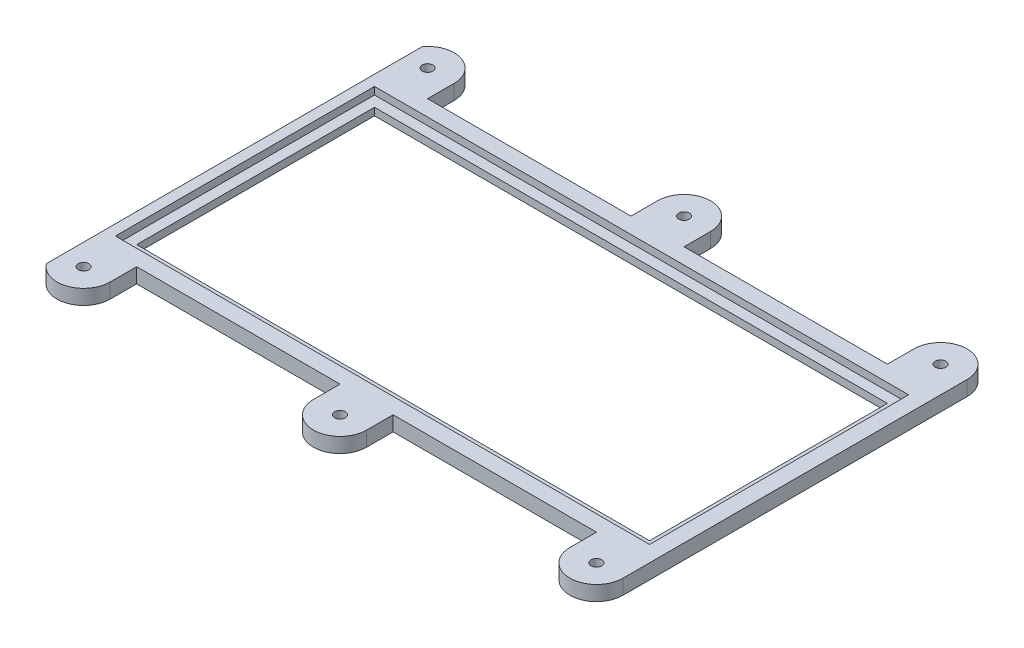
ISO-10303-21;
HEADER;
FILE_DESCRIPTION(('STEP AP214'),'2;1');
FILE_NAME('part.step','',(''),(''),'','','');
FILE_SCHEMA(('AUTOMOTIVE_DESIGN { 1 0 10303 214 1 1 1 1 }'));
ENDSEC;
DATA;
#1=APPLICATION_CONTEXT('core data for automotive mechanical design processes');
#2=APPLICATION_PROTOCOL_DEFINITION('international standard','automotive_design',2000,#1);
#3=PRODUCT_CONTEXT('',#1,'mechanical');
#4=PRODUCT('Part','Part','',(#3));
#5=PRODUCT_RELATED_PRODUCT_CATEGORY('part','',(#4));
#6=PRODUCT_DEFINITION_FORMATION('','',#4);
#7=PRODUCT_DEFINITION_CONTEXT('part definition',#1,'design');
#8=PRODUCT_DEFINITION('design','',#6,#7);
#9=PRODUCT_DEFINITION_SHAPE('','',#8);
#10=(LENGTH_UNIT() NAMED_UNIT(*) SI_UNIT(.MILLI.,.METRE.));
#11=(NAMED_UNIT(*) PLANE_ANGLE_UNIT() SI_UNIT($,.RADIAN.));
#12=(NAMED_UNIT(*) SI_UNIT($,.STERADIAN.) SOLID_ANGLE_UNIT());
#13=UNCERTAINTY_MEASURE_WITH_UNIT(LENGTH_MEASURE(1.E-05),#10,'distance_accuracy_value','');
#14=(GEOMETRIC_REPRESENTATION_CONTEXT(3) GLOBAL_UNCERTAINTY_ASSIGNED_CONTEXT((#13)) GLOBAL_UNIT_ASSIGNED_CONTEXT((#10,
#11,#12)) REPRESENTATION_CONTEXT('',''));
#15=CARTESIAN_POINT('',(0.,0.,0.));
#16=DIRECTION('',(0.,0.,1.));
#17=DIRECTION('',(1.,0.,0.));
#18=AXIS2_PLACEMENT_3D('',#15,#16,#17);
#19=CARTESIAN_POINT('',(26.65,0.7,-13.7));
#20=DIRECTION('',(0.,0.,1.));
#21=DIRECTION('',(1.,0.,0.));
#22=AXIS2_PLACEMENT_3D('',#19,#20,#21);
#23=PLANE('',#22);
#24=DIRECTION('',(0.,-1.,0.));
#25=VECTOR('',#24,1.);
#26=CARTESIAN_POINT('',(21.65,8.47106781186548,-13.7));
#27=LINE('',#26,#25);
#28=CARTESIAN_POINT('',(21.65,1.4,-13.7));
#29=VERTEX_POINT('',#28);
#30=CARTESIAN_POINT('',(21.65,0.,-13.7));
#31=VERTEX_POINT('',#30);
#32=EDGE_CURVE('E70',#29,#31,#27,.T.);
#33=ORIENTED_EDGE('',*,*,#32,.T.);
#34=DIRECTION('',(-1.,0.,0.));
#35=VECTOR('',#34,1.);
#36=CARTESIAN_POINT('',(26.65,0.,-13.7));
#37=LINE('',#36,#35);
#38=CARTESIAN_POINT('',(2.5,0.,-13.7));
#39=VERTEX_POINT('',#38);
#40=EDGE_CURVE('E56',#31,#39,#37,.T.);
#41=ORIENTED_EDGE('',*,*,#40,.T.);
#42=DIRECTION('',(0.,-1.,0.));
#43=VECTOR('',#42,1.);
#44=CARTESIAN_POINT('',(2.5,8.47106781186548,-13.7));
#45=LINE('',#44,#43);
#46=CARTESIAN_POINT('',(2.5,1.4,-13.7));
#47=VERTEX_POINT('',#46);
#48=EDGE_CURVE('E491',#47,#39,#45,.T.);
#49=ORIENTED_EDGE('',*,*,#48,.F.);
#50=DIRECTION('',(-1.,0.,0.));
#51=VECTOR('',#50,1.);
#52=CARTESIAN_POINT('',(26.65,1.4,-13.7));
#53=LINE('',#52,#51);
#54=EDGE_CURVE('E361',#29,#47,#53,.T.);
#55=ORIENTED_EDGE('',*,*,#54,.F.);
#56=EDGE_LOOP('',(#33,#41,#49,#55));
#57=FACE_BOUND('',#56,.T.);
#58=ADVANCED_FACE('F47',(#57),#23,.F.);
#59=CARTESIAN_POINT('',(26.65,0.7,13.7));
#60=DIRECTION('',(0.,0.,-1.));
#61=DIRECTION('',(-1.,0.,0.));
#62=AXIS2_PLACEMENT_3D('',#59,#60,#61);
#63=PLANE('',#62);
#64=DIRECTION('',(0.,-1.,0.));
#65=VECTOR('',#64,1.);
#66=CARTESIAN_POINT('',(-21.65,8.47106781186548,13.7));
#67=LINE('',#66,#65);
#68=CARTESIAN_POINT('',(-21.65,1.4,13.7));
#69=VERTEX_POINT('',#68);
#70=CARTESIAN_POINT('',(-21.65,0.,13.7));
#71=VERTEX_POINT('',#70);
#72=EDGE_CURVE('E261',#69,#71,#67,.T.);
#73=ORIENTED_EDGE('',*,*,#72,.T.);
#74=DIRECTION('',(1.,0.,0.));
#75=VECTOR('',#74,1.);
#76=CARTESIAN_POINT('',(26.65,0.,13.7));
#77=LINE('',#76,#75);
#78=CARTESIAN_POINT('',(-2.5,0.,13.7));
#79=VERTEX_POINT('',#78);
#80=EDGE_CURVE('E415',#71,#79,#77,.T.);
#81=ORIENTED_EDGE('',*,*,#80,.T.);
#82=DIRECTION('',(0.,-1.,0.));
#83=VECTOR('',#82,1.);
#84=CARTESIAN_POINT('',(-2.5,8.47106781186548,13.7));
#85=LINE('',#84,#83);
#86=CARTESIAN_POINT('',(-2.5,1.4,13.7));
#87=VERTEX_POINT('',#86);
#88=EDGE_CURVE('E307',#87,#79,#85,.T.);
#89=ORIENTED_EDGE('',*,*,#88,.F.);
#90=DIRECTION('',(1.,0.,0.));
#91=VECTOR('',#90,1.);
#92=CARTESIAN_POINT('',(-26.65,1.4,13.7));
#93=LINE('',#92,#91);
#94=EDGE_CURVE('E365',#69,#87,#93,.T.);
#95=ORIENTED_EDGE('',*,*,#94,.F.);
#96=EDGE_LOOP('',(#73,#81,#89,#95));
#97=FACE_BOUND('',#96,.T.);
#98=ADVANCED_FACE('F623',(#97),#63,.F.);
#99=CARTESIAN_POINT('',(0.,0.7,0.));
#100=DIRECTION('',(0.,1.,0.));
#101=DIRECTION('',(0.,0.,1.));
#102=AXIS2_PLACEMENT_3D('',#99,#100,#101);
#103=PLANE('',#102);
#104=DIRECTION('',(1.,0.,0.));
#105=VECTOR('',#104,1.);
#106=CARTESIAN_POINT('',(24.15,0.7,11.2));
#107=LINE('',#106,#105);
#108=CARTESIAN_POINT('',(-24.15,0.7,11.2));
#109=VERTEX_POINT('',#108);
#110=CARTESIAN_POINT('',(24.15,0.7,11.2));
#111=VERTEX_POINT('',#110);
#112=EDGE_CURVE('E375',#109,#111,#107,.T.);
#113=ORIENTED_EDGE('',*,*,#112,.F.);
#114=DIRECTION('',(0.,0.,1.));
#115=VECTOR('',#114,1.);
#116=CARTESIAN_POINT('',(-24.15,0.7,11.2));
#117=LINE('',#116,#115);
#118=CARTESIAN_POINT('',(-24.15,0.7,-11.2));
#119=VERTEX_POINT('',#118);
#120=EDGE_CURVE('E372',#119,#109,#117,.T.);
#121=ORIENTED_EDGE('',*,*,#120,.F.);
#122=DIRECTION('',(-1.,0.,0.));
#123=VECTOR('',#122,1.);
#124=CARTESIAN_POINT('',(24.15,0.7,-11.2));
#125=LINE('',#124,#123);
#126=CARTESIAN_POINT('',(24.15,0.7,-11.2));
#127=VERTEX_POINT('',#126);
#128=EDGE_CURVE('E383',#127,#119,#125,.T.);
#129=ORIENTED_EDGE('',*,*,#128,.F.);
#130=DIRECTION('',(0.,0.,-1.));
#131=VECTOR('',#130,1.);
#132=CARTESIAN_POINT('',(24.15,0.7,11.2));
#133=LINE('',#132,#131);
#134=EDGE_CURVE('E379',#111,#127,#133,.T.);
#135=ORIENTED_EDGE('',*,*,#134,.F.);
#136=EDGE_LOOP('',(#113,#121,#129,#135));
#137=FACE_BOUND('',#136,.T.);
#138=DIRECTION('',(0.,0.,-1.));
#139=VECTOR('',#138,1.);
#140=CARTESIAN_POINT('',(25.15,0.7,12.2));
#141=LINE('',#140,#139);
#142=CARTESIAN_POINT('',(25.15,0.7,12.2));
#143=VERTEX_POINT('',#142);
#144=CARTESIAN_POINT('',(25.15,0.7,-12.2));
#145=VERTEX_POINT('',#144);
#146=EDGE_CURVE('E323',#143,#145,#141,.T.);
#147=ORIENTED_EDGE('',*,*,#146,.T.);
#148=DIRECTION('',(-1.,0.,0.));
#149=VECTOR('',#148,1.);
#150=CARTESIAN_POINT('',(25.15,0.7,-12.2));
#151=LINE('',#150,#149);
#152=CARTESIAN_POINT('',(-25.15,0.7,-12.2));
#153=VERTEX_POINT('',#152);
#154=EDGE_CURVE('E286',#145,#153,#151,.T.);
#155=ORIENTED_EDGE('',*,*,#154,.T.);
#156=DIRECTION('',(0.,0.,1.));
#157=VECTOR('',#156,1.);
#158=CARTESIAN_POINT('',(-25.15,0.7,-12.2));
#159=LINE('',#158,#157);
#160=CARTESIAN_POINT('',(-25.15,0.7,12.2));
#161=VERTEX_POINT('',#160);
#162=EDGE_CURVE('E337',#153,#161,#159,.T.);
#163=ORIENTED_EDGE('',*,*,#162,.T.);
#164=DIRECTION('',(1.,0.,0.));
#165=VECTOR('',#164,1.);
#166=CARTESIAN_POINT('',(-25.15,0.7,12.2));
#167=LINE('',#166,#165);
#168=EDGE_CURVE('E341',#161,#143,#167,.T.);
#169=ORIENTED_EDGE('',*,*,#168,.T.);
#170=EDGE_LOOP('',(#147,#155,#163,#169));
#171=FACE_BOUND('',#170,.T.);
#172=ADVANCED_FACE('F550',(#137,#171),#103,.T.);
#173=CARTESIAN_POINT('',(0.,0.,0.));
#174=DIRECTION('',(0.,1.,0.));
#175=DIRECTION('',(0.,0.,1.));
#176=AXIS2_PLACEMENT_3D('',#173,#174,#175);
#177=PLANE('',#176);
#178=CARTESIAN_POINT('',(-24.15,0.,16.2));
#179=DIRECTION('',(0.,-1.,0.));
#180=DIRECTION('',(0.,0.,-1.));
#181=AXIS2_PLACEMENT_3D('',#178,#179,#180);
#182=CIRCLE('',#181,2.5);
#183=CARTESIAN_POINT('',(-21.65,0.,16.2));
#184=VERTEX_POINT('',#183);
#185=CARTESIAN_POINT('',(-26.15,0.,17.7));
#186=VERTEX_POINT('',#185);
#187=EDGE_CURVE('E246',#184,#186,#182,.T.);
#188=ORIENTED_EDGE('',*,*,#187,.T.);
#189=DIRECTION('',(0.,0.,-1.));
#190=VECTOR('',#189,1.);
#191=CARTESIAN_POINT('',(-26.15,0.,-26.9384030132517));
#192=LINE('',#191,#190);
#193=CARTESIAN_POINT('',(-26.15,0.,-17.7));
#194=VERTEX_POINT('',#193);
#195=EDGE_CURVE('E231',#186,#194,#192,.T.);
#196=ORIENTED_EDGE('',*,*,#195,.T.);
#197=CARTESIAN_POINT('',(-24.15,0.,-16.2));
#198=DIRECTION('',(0.,1.,0.));
#199=DIRECTION('',(0.,0.,1.));
#200=AXIS2_PLACEMENT_3D('',#197,#198,#199);
#201=CIRCLE('',#200,2.5);
#202=CARTESIAN_POINT('',(-21.65,0.,-16.2));
#203=VERTEX_POINT('',#202);
#204=EDGE_CURVE('E445',#203,#194,#201,.T.);
#205=ORIENTED_EDGE('',*,*,#204,.F.);
#206=DIRECTION('',(0.,0.,1.));
#207=VECTOR('',#206,1.);
#208=CARTESIAN_POINT('',(-21.65,0.,0.));
#209=LINE('',#208,#207);
#210=CARTESIAN_POINT('',(-21.65,0.,-13.7));
#211=VERTEX_POINT('',#210);
#212=EDGE_CURVE('E444',#203,#211,#209,.T.);
#213=ORIENTED_EDGE('',*,*,#212,.T.);
#214=CARTESIAN_POINT('',(-2.5,0.,-13.7));
#215=VERTEX_POINT('',#214);
#216=EDGE_CURVE('E420',#215,#211,#37,.T.);
#217=ORIENTED_EDGE('',*,*,#216,.F.);
#218=DIRECTION('',(0.,0.,1.));
#219=VECTOR('',#218,1.);
#220=CARTESIAN_POINT('',(-2.5,0.,0.));
#221=LINE('',#220,#219);
#222=CARTESIAN_POINT('',(-2.5,0.,-16.2));
#223=VERTEX_POINT('',#222);
#224=EDGE_CURVE('E441',#223,#215,#221,.T.);
#225=ORIENTED_EDGE('',*,*,#224,.F.);
#226=CARTESIAN_POINT('',(0.,0.,-16.2));
#227=DIRECTION('',(0.,1.,0.));
#228=DIRECTION('',(0.,0.,1.));
#229=AXIS2_PLACEMENT_3D('',#226,#227,#228);
#230=CIRCLE('',#229,2.5);
#231=CARTESIAN_POINT('',(2.5,0.,-16.2));
#232=VERTEX_POINT('',#231);
#233=EDGE_CURVE('E488',#232,#223,#230,.T.);
#234=ORIENTED_EDGE('',*,*,#233,.F.);
#235=DIRECTION('',(0.,0.,1.));
#236=VECTOR('',#235,1.);
#237=CARTESIAN_POINT('',(2.5,0.,0.));
#238=LINE('',#237,#236);
#239=EDGE_CURVE('E482',#232,#39,#238,.T.);
#240=ORIENTED_EDGE('',*,*,#239,.T.);
#241=ORIENTED_EDGE('',*,*,#40,.F.);
#242=DIRECTION('',(0.,0.,1.));
#243=VECTOR('',#242,1.);
#244=CARTESIAN_POINT('',(21.65,0.,0.));
#245=LINE('',#244,#243);
#246=CARTESIAN_POINT('',(21.65,0.,-16.2));
#247=VERTEX_POINT('',#246);
#248=EDGE_CURVE('E563',#247,#31,#245,.T.);
#249=ORIENTED_EDGE('',*,*,#248,.F.);
#250=CARTESIAN_POINT('',(24.15,0.,-16.2));
#251=DIRECTION('',(0.,1.,0.));
#252=DIRECTION('',(0.,0.,1.));
#253=AXIS2_PLACEMENT_3D('',#250,#251,#252);
#254=CIRCLE('',#253,2.5);
#255=CARTESIAN_POINT('',(26.65,0.,-16.2));
#256=VERTEX_POINT('',#255);
#257=EDGE_CURVE('E568',#256,#247,#254,.T.);
#258=ORIENTED_EDGE('',*,*,#257,.F.);
#259=DIRECTION('',(0.,0.,-1.));
#260=VECTOR('',#259,1.);
#261=CARTESIAN_POINT('',(26.65,0.,13.7));
#262=LINE('',#261,#260);
#263=CARTESIAN_POINT('',(26.65,0.,16.2));
#264=VERTEX_POINT('',#263);
#265=EDGE_CURVE('E418',#264,#256,#262,.T.);
#266=ORIENTED_EDGE('',*,*,#265,.F.);
#267=CARTESIAN_POINT('',(24.15,0.,16.2));
#268=DIRECTION('',(0.,-1.,0.));
#269=DIRECTION('',(0.,0.,-1.));
#270=AXIS2_PLACEMENT_3D('',#267,#268,#269);
#271=CIRCLE('',#270,2.5);
#272=CARTESIAN_POINT('',(21.65,0.,16.2));
#273=VERTEX_POINT('',#272);
#274=EDGE_CURVE('E515',#264,#273,#271,.T.);
#275=ORIENTED_EDGE('',*,*,#274,.T.);
#276=DIRECTION('',(0.,0.,-1.));
#277=VECTOR('',#276,1.);
#278=CARTESIAN_POINT('',(21.65,0.,0.));
#279=LINE('',#278,#277);
#280=CARTESIAN_POINT('',(21.65,0.,13.7));
#281=VERTEX_POINT('',#280);
#282=EDGE_CURVE('E519',#273,#281,#279,.T.);
#283=ORIENTED_EDGE('',*,*,#282,.T.);
#284=CARTESIAN_POINT('',(2.5,0.,13.7));
#285=VERTEX_POINT('',#284);
#286=EDGE_CURVE('E414',#285,#281,#77,.T.);
#287=ORIENTED_EDGE('',*,*,#286,.F.);
#288=DIRECTION('',(0.,0.,-1.));
#289=VECTOR('',#288,1.);
#290=CARTESIAN_POINT('',(2.5,0.,0.));
#291=LINE('',#290,#289);
#292=CARTESIAN_POINT('',(2.5,0.,16.2));
#293=VERTEX_POINT('',#292);
#294=EDGE_CURVE('E291',#293,#285,#291,.T.);
#295=ORIENTED_EDGE('',*,*,#294,.F.);
#296=CARTESIAN_POINT('',(0.,0.,16.2));
#297=DIRECTION('',(0.,-1.,0.));
#298=DIRECTION('',(0.,0.,-1.));
#299=AXIS2_PLACEMENT_3D('',#296,#297,#298);
#300=CIRCLE('',#299,2.5);
#301=CARTESIAN_POINT('',(-2.5,0.,16.2));
#302=VERTEX_POINT('',#301);
#303=EDGE_CURVE('E295',#293,#302,#300,.T.);
#304=ORIENTED_EDGE('',*,*,#303,.T.);
#305=DIRECTION('',(0.,0.,-1.));
#306=VECTOR('',#305,1.);
#307=CARTESIAN_POINT('',(-2.5,0.,0.));
#308=LINE('',#307,#306);
#309=EDGE_CURVE('E299',#302,#79,#308,.T.);
#310=ORIENTED_EDGE('',*,*,#309,.T.);
#311=ORIENTED_EDGE('',*,*,#80,.F.);
#312=DIRECTION('',(0.,0.,-1.));
#313=VECTOR('',#312,1.);
#314=CARTESIAN_POINT('',(-21.65,0.,0.));
#315=LINE('',#314,#313);
#316=EDGE_CURVE('E255',#184,#71,#315,.T.);
#317=ORIENTED_EDGE('',*,*,#316,.F.);
#318=EDGE_LOOP('',(#188,#196,#205,#213,#217,#225,#234,#240,#241,#249,#258,#266,#275,#283,#287,
#295,#304,#310,#311,#317));
#319=FACE_BOUND('',#318,.T.);
#320=DIRECTION('',(0.,0.,1.));
#321=VECTOR('',#320,1.);
#322=CARTESIAN_POINT('',(-24.15,0.,11.2));
#323=LINE('',#322,#321);
#324=CARTESIAN_POINT('',(-24.15,0.,-11.2));
#325=VERTEX_POINT('',#324);
#326=CARTESIAN_POINT('',(-24.15,0.,11.2));
#327=VERTEX_POINT('',#326);
#328=EDGE_CURVE('E371',#325,#327,#323,.T.);
#329=ORIENTED_EDGE('',*,*,#328,.T.);
#330=DIRECTION('',(1.,0.,0.));
#331=VECTOR('',#330,1.);
#332=CARTESIAN_POINT('',(24.15,0.,11.2));
#333=LINE('',#332,#331);
#334=CARTESIAN_POINT('',(24.15,0.,11.2));
#335=VERTEX_POINT('',#334);
#336=EDGE_CURVE('E390',#327,#335,#333,.T.);
#337=ORIENTED_EDGE('',*,*,#336,.T.);
#338=DIRECTION('',(0.,0.,-1.));
#339=VECTOR('',#338,1.);
#340=CARTESIAN_POINT('',(24.15,0.,11.2));
#341=LINE('',#340,#339);
#342=CARTESIAN_POINT('',(24.15,0.,-11.2));
#343=VERTEX_POINT('',#342);
#344=EDGE_CURVE('E394',#335,#343,#341,.T.);
#345=ORIENTED_EDGE('',*,*,#344,.T.);
#346=DIRECTION('',(-1.,0.,0.));
#347=VECTOR('',#346,1.);
#348=CARTESIAN_POINT('',(24.15,0.,-11.2));
#349=LINE('',#348,#347);
#350=EDGE_CURVE('E376',#343,#325,#349,.T.);
#351=ORIENTED_EDGE('',*,*,#350,.T.);
#352=EDGE_LOOP('',(#329,#337,#345,#351));
#353=FACE_BOUND('',#352,.T.);
#354=CARTESIAN_POINT('',(0.,0.,16.2));
#355=DIRECTION('',(0.,-1.,0.));
#356=DIRECTION('',(0.,0.,-1.));
#357=AXIS2_PLACEMENT_3D('',#354,#355,#356);
#358=CIRCLE('',#357,0.500000000000001);
#359=CARTESIAN_POINT('',(0.,0.,15.7));
#360=VERTEX_POINT('',#359);
#361=EDGE_CURVE('E281',#360,#360,#358,.T.);
#362=ORIENTED_EDGE('',*,*,#361,.F.);
#363=EDGE_LOOP('',(#362));
#364=FACE_BOUND('',#363,.T.);
#365=CARTESIAN_POINT('',(-24.15,0.,16.2));
#366=DIRECTION('',(0.,-1.,0.));
#367=DIRECTION('',(0.,0.,-1.));
#368=AXIS2_PLACEMENT_3D('',#365,#366,#367);
#369=CIRCLE('',#368,0.499999999999999);
#370=CARTESIAN_POINT('',(-24.15,0.,15.7));
#371=VERTEX_POINT('',#370);
#372=EDGE_CURVE('E263',#371,#371,#369,.T.);
#373=ORIENTED_EDGE('',*,*,#372,.F.);
#374=EDGE_LOOP('',(#373));
#375=FACE_BOUND('',#374,.T.);
#376=CARTESIAN_POINT('',(24.15,0.,16.2));
#377=DIRECTION('',(0.,-1.,0.));
#378=DIRECTION('',(0.,0.,-1.));
#379=AXIS2_PLACEMENT_3D('',#376,#377,#378);
#380=CIRCLE('',#379,0.499999999999999);
#381=CARTESIAN_POINT('',(24.15,0.,15.7));
#382=VERTEX_POINT('',#381);
#383=EDGE_CURVE('E505',#382,#382,#380,.T.);
#384=ORIENTED_EDGE('',*,*,#383,.F.);
#385=EDGE_LOOP('',(#384));
#386=FACE_BOUND('',#385,.T.);
#387=CARTESIAN_POINT('',(0.,0.,-16.2));
#388=DIRECTION('',(0.,1.,0.));
#389=DIRECTION('',(0.,0.,1.));
#390=AXIS2_PLACEMENT_3D('',#387,#388,#389);
#391=CIRCLE('',#390,0.500000000000001);
#392=CARTESIAN_POINT('',(0.,0.,-15.7));
#393=VERTEX_POINT('',#392);
#394=EDGE_CURVE('E478',#393,#393,#391,.T.);
#395=ORIENTED_EDGE('',*,*,#394,.T.);
#396=EDGE_LOOP('',(#395));
#397=FACE_BOUND('',#396,.T.);
#398=CARTESIAN_POINT('',(-24.15,0.,-16.2));
#399=DIRECTION('',(0.,1.,0.));
#400=DIRECTION('',(0.,0.,1.));
#401=AXIS2_PLACEMENT_3D('',#398,#399,#400);
#402=CIRCLE('',#401,0.499999999999999);
#403=CARTESIAN_POINT('',(-24.15,0.,-15.7));
#404=VERTEX_POINT('',#403);
#405=EDGE_CURVE('E449',#404,#404,#402,.T.);
#406=ORIENTED_EDGE('',*,*,#405,.T.);
#407=EDGE_LOOP('',(#406));
#408=FACE_BOUND('',#407,.T.);
#409=CARTESIAN_POINT('',(24.15,0.,-16.2));
#410=DIRECTION('',(0.,1.,0.));
#411=DIRECTION('',(0.,0.,1.));
#412=AXIS2_PLACEMENT_3D('',#409,#410,#411);
#413=CIRCLE('',#412,0.499999999999999);
#414=CARTESIAN_POINT('',(24.15,0.,-15.7));
#415=VERTEX_POINT('',#414);
#416=EDGE_CURVE('E560',#415,#415,#413,.T.);
#417=ORIENTED_EDGE('',*,*,#416,.T.);
#418=EDGE_LOOP('',(#417));
#419=FACE_BOUND('',#418,.T.);
#420=ADVANCED_FACE('F252',(#319,#353,#364,#375,#386,#397,#408,#419),#177,.F.);
#421=ORIENTED_EDGE('',*,*,#286,.T.);
#422=DIRECTION('',(0.,-1.,0.));
#423=VECTOR('',#422,1.);
#424=CARTESIAN_POINT('',(21.65,8.47106781186548,13.7));
#425=LINE('',#424,#423);
#426=CARTESIAN_POINT('',(21.65,1.4,13.7));
#427=VERTEX_POINT('',#426);
#428=EDGE_CURVE('E524',#427,#281,#425,.T.);
#429=ORIENTED_EDGE('',*,*,#428,.F.);
#430=CARTESIAN_POINT('',(2.5,1.4,13.7));
#431=VERTEX_POINT('',#430);
#432=EDGE_CURVE('E364',#431,#427,#93,.T.);
#433=ORIENTED_EDGE('',*,*,#432,.F.);
#434=DIRECTION('',(0.,-1.,0.));
#435=VECTOR('',#434,1.);
#436=CARTESIAN_POINT('',(2.5,8.47106781186548,13.7));
#437=LINE('',#436,#435);
#438=EDGE_CURVE('E304',#431,#285,#437,.T.);
#439=ORIENTED_EDGE('',*,*,#438,.T.);
#440=EDGE_LOOP('',(#421,#429,#433,#439));
#441=FACE_BOUND('',#440,.T.);
#442=ADVANCED_FACE('F49',(#441),#63,.F.);
#443=CARTESIAN_POINT('',(26.65,0.7,13.7));
#444=DIRECTION('',(-1.,0.,0.));
#445=DIRECTION('',(0.,0.,1.));
#446=AXIS2_PLACEMENT_3D('',#443,#444,#445);
#447=PLANE('',#446);
#448=ORIENTED_EDGE('',*,*,#265,.T.);
#449=DIRECTION('',(0.,-1.,0.));
#450=VECTOR('',#449,1.);
#451=CARTESIAN_POINT('',(26.65,8.47106781186548,-16.2));
#452=LINE('',#451,#450);
#453=CARTESIAN_POINT('',(26.65,1.4,-16.2));
#454=VERTEX_POINT('',#453);
#455=EDGE_CURVE('E578',#454,#256,#452,.T.);
#456=ORIENTED_EDGE('',*,*,#455,.F.);
#457=DIRECTION('',(0.,0.,-1.));
#458=VECTOR('',#457,1.);
#459=CARTESIAN_POINT('',(26.65,1.4,13.7));
#460=LINE('',#459,#458);
#461=CARTESIAN_POINT('',(26.65,1.4,16.2));
#462=VERTEX_POINT('',#461);
#463=EDGE_CURVE('E368',#462,#454,#460,.T.);
#464=ORIENTED_EDGE('',*,*,#463,.F.);
#465=DIRECTION('',(0.,-1.,0.));
#466=VECTOR('',#465,1.);
#467=CARTESIAN_POINT('',(26.65,8.47106781186548,16.2));
#468=LINE('',#467,#466);
#469=EDGE_CURVE('E523',#462,#264,#468,.T.);
#470=ORIENTED_EDGE('',*,*,#469,.T.);
#471=EDGE_LOOP('',(#448,#456,#464,#470));
#472=FACE_BOUND('',#471,.T.);
#473=ADVANCED_FACE('F631',(#472),#447,.F.);
#474=ORIENTED_EDGE('',*,*,#216,.T.);
#475=DIRECTION('',(0.,-1.,0.));
#476=VECTOR('',#475,1.);
#477=CARTESIAN_POINT('',(-21.65,8.47106781186548,-13.7));
#478=LINE('',#477,#476);
#479=CARTESIAN_POINT('',(-21.65,1.4,-13.7));
#480=VERTEX_POINT('',#479);
#481=EDGE_CURVE('E434',#480,#211,#478,.T.);
#482=ORIENTED_EDGE('',*,*,#481,.F.);
#483=CARTESIAN_POINT('',(-2.5,1.4,-13.7));
#484=VERTEX_POINT('',#483);
#485=EDGE_CURVE('E360',#484,#480,#53,.T.);
#486=ORIENTED_EDGE('',*,*,#485,.F.);
#487=DIRECTION('',(0.,-1.,0.));
#488=VECTOR('',#487,1.);
#489=CARTESIAN_POINT('',(-2.5,8.47106781186548,-13.7));
#490=LINE('',#489,#488);
#491=EDGE_CURVE('E437',#484,#215,#490,.T.);
#492=ORIENTED_EDGE('',*,*,#491,.T.);
#493=EDGE_LOOP('',(#474,#482,#486,#492));
#494=FACE_BOUND('',#493,.T.);
#495=ADVANCED_FACE('F432',(#494),#23,.F.);
#496=CARTESIAN_POINT('',(-24.15,0.7,11.2));
#497=DIRECTION('',(1.,0.,0.));
#498=DIRECTION('',(0.,0.,-1.));
#499=AXIS2_PLACEMENT_3D('',#496,#497,#498);
#500=PLANE('',#499);
#501=ORIENTED_EDGE('',*,*,#328,.F.);
#502=DIRECTION('',(0.,-1.,0.));
#503=VECTOR('',#502,1.);
#504=CARTESIAN_POINT('',(-24.15,0.7,-11.2));
#505=LINE('',#504,#503);
#506=EDGE_CURVE('E386',#119,#325,#505,.T.);
#507=ORIENTED_EDGE('',*,*,#506,.F.);
#508=ORIENTED_EDGE('',*,*,#120,.T.);
#509=DIRECTION('',(0.,-1.,0.));
#510=VECTOR('',#509,1.);
#511=CARTESIAN_POINT('',(-24.15,0.7,11.2));
#512=LINE('',#511,#510);
#513=EDGE_CURVE('E410',#109,#327,#512,.T.);
#514=ORIENTED_EDGE('',*,*,#513,.T.);
#515=EDGE_LOOP('',(#501,#507,#508,#514));
#516=FACE_BOUND('',#515,.T.);
#517=ADVANCED_FACE('F630',(#516),#500,.T.);
#518=CARTESIAN_POINT('',(24.15,0.7,11.2));
#519=DIRECTION('',(0.,0.,-1.));
#520=DIRECTION('',(-1.,0.,0.));
#521=AXIS2_PLACEMENT_3D('',#518,#519,#520);
#522=PLANE('',#521);
#523=ORIENTED_EDGE('',*,*,#336,.F.);
#524=ORIENTED_EDGE('',*,*,#513,.F.);
#525=ORIENTED_EDGE('',*,*,#112,.T.);
#526=DIRECTION('',(0.,-1.,0.));
#527=VECTOR('',#526,1.);
#528=CARTESIAN_POINT('',(24.15,0.7,11.2));
#529=LINE('',#528,#527);
#530=EDGE_CURVE('E407',#111,#335,#529,.T.);
#531=ORIENTED_EDGE('',*,*,#530,.T.);
#532=EDGE_LOOP('',(#523,#524,#525,#531));
#533=FACE_BOUND('',#532,.T.);
#534=ADVANCED_FACE('F636',(#533),#522,.T.);
#535=CARTESIAN_POINT('',(24.15,0.7,11.2));
#536=DIRECTION('',(-1.,0.,0.));
#537=DIRECTION('',(0.,0.,1.));
#538=AXIS2_PLACEMENT_3D('',#535,#536,#537);
#539=PLANE('',#538);
#540=ORIENTED_EDGE('',*,*,#344,.F.);
#541=ORIENTED_EDGE('',*,*,#530,.F.);
#542=ORIENTED_EDGE('',*,*,#134,.T.);
#543=DIRECTION('',(0.,-1.,0.));
#544=VECTOR('',#543,1.);
#545=CARTESIAN_POINT('',(24.15,0.7,-11.2));
#546=LINE('',#545,#544);
#547=EDGE_CURVE('E404',#127,#343,#546,.T.);
#548=ORIENTED_EDGE('',*,*,#547,.T.);
#549=EDGE_LOOP('',(#540,#541,#542,#548));
#550=FACE_BOUND('',#549,.T.);
#551=ADVANCED_FACE('F752',(#550),#539,.T.);
#552=CARTESIAN_POINT('',(24.15,0.7,-11.2));
#553=DIRECTION('',(0.,0.,1.));
#554=DIRECTION('',(1.,0.,0.));
#555=AXIS2_PLACEMENT_3D('',#552,#553,#554);
#556=PLANE('',#555);
#557=ORIENTED_EDGE('',*,*,#350,.F.);
#558=ORIENTED_EDGE('',*,*,#547,.F.);
#559=ORIENTED_EDGE('',*,*,#128,.T.);
#560=ORIENTED_EDGE('',*,*,#506,.T.);
#561=EDGE_LOOP('',(#557,#558,#559,#560));
#562=FACE_BOUND('',#561,.T.);
#563=ADVANCED_FACE('F603',(#562),#556,.T.);
#564=CARTESIAN_POINT('',(0.,1.4,0.));
#565=DIRECTION('',(0.,1.,0.));
#566=DIRECTION('',(0.,0.,1.));
#567=AXIS2_PLACEMENT_3D('',#564,#565,#566);
#568=PLANE('',#567);
#569=DIRECTION('',(0.,0.,-1.));
#570=VECTOR('',#569,1.);
#571=CARTESIAN_POINT('',(-26.15,1.4,0.));
#572=LINE('',#571,#570);
#573=CARTESIAN_POINT('',(-26.15,1.4,17.7));
#574=VERTEX_POINT('',#573);
#575=CARTESIAN_POINT('',(-26.15,1.4,-17.7));
#576=VERTEX_POINT('',#575);
#577=EDGE_CURVE('E63',#574,#576,#572,.T.);
#578=ORIENTED_EDGE('',*,*,#577,.F.);
#579=CARTESIAN_POINT('',(-24.15,1.4,16.2));
#580=DIRECTION('',(0.,1.,0.));
#581=DIRECTION('',(0.,0.,1.));
#582=AXIS2_PLACEMENT_3D('',#579,#580,#581);
#583=CIRCLE('',#582,2.5);
#584=CARTESIAN_POINT('',(-21.65,1.4,16.2));
#585=VERTEX_POINT('',#584);
#586=EDGE_CURVE('E247',#585,#574,#583,.F.);
#587=ORIENTED_EDGE('',*,*,#586,.F.);
#588=DIRECTION('',(0.,0.,-1.));
#589=VECTOR('',#588,1.);
#590=CARTESIAN_POINT('',(-21.65,1.4,0.));
#591=LINE('',#590,#589);
#592=EDGE_CURVE('E510',#585,#69,#591,.T.);
#593=ORIENTED_EDGE('',*,*,#592,.T.);
#594=ORIENTED_EDGE('',*,*,#94,.T.);
#595=DIRECTION('',(0.,0.,-1.));
#596=VECTOR('',#595,1.);
#597=CARTESIAN_POINT('',(-2.5,1.4,0.));
#598=LINE('',#597,#596);
#599=CARTESIAN_POINT('',(-2.5,1.4,16.2));
#600=VERTEX_POINT('',#599);
#601=EDGE_CURVE('E273',#600,#87,#598,.T.);
#602=ORIENTED_EDGE('',*,*,#601,.F.);
#603=CARTESIAN_POINT('',(0.,1.4,16.2));
#604=DIRECTION('',(0.,1.,0.));
#605=DIRECTION('',(0.,0.,1.));
#606=AXIS2_PLACEMENT_3D('',#603,#604,#605);
#607=CIRCLE('',#606,2.5);
#608=CARTESIAN_POINT('',(2.5,1.4,16.2));
#609=VERTEX_POINT('',#608);
#610=EDGE_CURVE('E287',#609,#600,#607,.F.);
#611=ORIENTED_EDGE('',*,*,#610,.F.);
#612=DIRECTION('',(0.,0.,-1.));
#613=VECTOR('',#612,1.);
#614=CARTESIAN_POINT('',(2.5,1.4,0.));
#615=LINE('',#614,#613);
#616=EDGE_CURVE('E277',#609,#431,#615,.T.);
#617=ORIENTED_EDGE('',*,*,#616,.T.);
#618=ORIENTED_EDGE('',*,*,#432,.T.);
#619=DIRECTION('',(0.,0.,-1.));
#620=VECTOR('',#619,1.);
#621=CARTESIAN_POINT('',(21.65,1.4,0.));
#622=LINE('',#621,#620);
#623=CARTESIAN_POINT('',(21.65,1.4,16.2));
#624=VERTEX_POINT('',#623);
#625=EDGE_CURVE('E495',#624,#427,#622,.T.);
#626=ORIENTED_EDGE('',*,*,#625,.F.);
#627=CARTESIAN_POINT('',(24.15,1.4,16.2));
#628=DIRECTION('',(0.,1.,0.));
#629=DIRECTION('',(0.,0.,1.));
#630=AXIS2_PLACEMENT_3D('',#627,#628,#629);
#631=CIRCLE('',#630,2.5);
#632=EDGE_CURVE('E511',#462,#624,#631,.F.);
#633=ORIENTED_EDGE('',*,*,#632,.F.);
#634=ORIENTED_EDGE('',*,*,#463,.T.);
#635=CARTESIAN_POINT('',(24.15,1.4,-16.2));
#636=DIRECTION('',(0.,1.,0.));
#637=DIRECTION('',(0.,0.,1.));
#638=AXIS2_PLACEMENT_3D('',#635,#636,#637);
#639=CIRCLE('',#638,2.5);
#640=CARTESIAN_POINT('',(21.65,1.4,-16.2));
#641=VERTEX_POINT('',#640);
#642=EDGE_CURVE('E571',#454,#641,#639,.T.);
#643=ORIENTED_EDGE('',*,*,#642,.T.);
#644=DIRECTION('',(0.,0.,1.));
#645=VECTOR('',#644,1.);
#646=CARTESIAN_POINT('',(21.65,1.4,0.));
#647=LINE('',#646,#645);
#648=EDGE_CURVE('E249',#641,#29,#647,.T.);
#649=ORIENTED_EDGE('',*,*,#648,.T.);
#650=ORIENTED_EDGE('',*,*,#54,.T.);
#651=DIRECTION('',(0.,0.,1.));
#652=VECTOR('',#651,1.);
#653=CARTESIAN_POINT('',(2.5,1.4,0.));
#654=LINE('',#653,#652);
#655=CARTESIAN_POINT('',(2.5,1.4,-16.2));
#656=VERTEX_POINT('',#655);
#657=EDGE_CURVE('E470',#656,#47,#654,.T.);
#658=ORIENTED_EDGE('',*,*,#657,.F.);
#659=CARTESIAN_POINT('',(0.,1.4,-16.2));
#660=DIRECTION('',(0.,1.,0.));
#661=DIRECTION('',(0.,0.,1.));
#662=AXIS2_PLACEMENT_3D('',#659,#660,#661);
#663=CIRCLE('',#662,2.5);
#664=CARTESIAN_POINT('',(-2.5,1.4,-16.2));
#665=VERTEX_POINT('',#664);
#666=EDGE_CURVE('E467',#656,#665,#663,.T.);
#667=ORIENTED_EDGE('',*,*,#666,.T.);
#668=DIRECTION('',(0.,0.,1.));
#669=VECTOR('',#668,1.);
#670=CARTESIAN_POINT('',(-2.5,1.4,0.));
#671=LINE('',#670,#669);
#672=EDGE_CURVE('E462',#665,#484,#671,.T.);
#673=ORIENTED_EDGE('',*,*,#672,.T.);
#674=ORIENTED_EDGE('',*,*,#485,.T.);
#675=DIRECTION('',(0.,0.,1.));
#676=VECTOR('',#675,1.);
#677=CARTESIAN_POINT('',(-21.65,1.4,0.));
#678=LINE('',#677,#676);
#679=CARTESIAN_POINT('',(-21.65,1.4,-16.2));
#680=VERTEX_POINT('',#679);
#681=EDGE_CURVE('E591',#680,#480,#678,.T.);
#682=ORIENTED_EDGE('',*,*,#681,.F.);
#683=CARTESIAN_POINT('',(-24.15,1.4,-16.2));
#684=DIRECTION('',(0.,1.,0.));
#685=DIRECTION('',(0.,0.,1.));
#686=AXIS2_PLACEMENT_3D('',#683,#684,#685);
#687=CIRCLE('',#686,2.5);
#688=EDGE_CURVE('E582',#680,#576,#687,.T.);
#689=ORIENTED_EDGE('',*,*,#688,.T.);
#690=EDGE_LOOP('',(#578,#587,#593,#594,#602,#611,#617,#618,#626,#633,#634,#643,#649,#650,#658,
#667,#673,#674,#682,#689));
#691=FACE_BOUND('',#690,.T.);
#692=DIRECTION('',(0.,0.,1.));
#693=VECTOR('',#692,1.);
#694=CARTESIAN_POINT('',(-25.15,1.4,-12.2));
#695=LINE('',#694,#693);
#696=CARTESIAN_POINT('',(-25.15,1.4,-12.2));
#697=VERTEX_POINT('',#696);
#698=CARTESIAN_POINT('',(-25.15,1.4,12.2));
#699=VERTEX_POINT('',#698);
#700=EDGE_CURVE('E322',#697,#699,#695,.T.);
#701=ORIENTED_EDGE('',*,*,#700,.F.);
#702=DIRECTION('',(-1.,0.,0.));
#703=VECTOR('',#702,1.);
#704=CARTESIAN_POINT('',(25.15,1.4,-12.2));
#705=LINE('',#704,#703);
#706=CARTESIAN_POINT('',(25.15,1.4,-12.2));
#707=VERTEX_POINT('',#706);
#708=EDGE_CURVE('E319',#707,#697,#705,.T.);
#709=ORIENTED_EDGE('',*,*,#708,.F.);
#710=DIRECTION('',(0.,0.,-1.));
#711=VECTOR('',#710,1.);
#712=CARTESIAN_POINT('',(25.15,1.4,12.2));
#713=LINE('',#712,#711);
#714=CARTESIAN_POINT('',(25.15,1.4,12.2));
#715=VERTEX_POINT('',#714);
#716=EDGE_CURVE('E330',#715,#707,#713,.T.);
#717=ORIENTED_EDGE('',*,*,#716,.F.);
#718=DIRECTION('',(1.,0.,0.));
#719=VECTOR('',#718,1.);
#720=CARTESIAN_POINT('',(-25.15,1.4,12.2));
#721=LINE('',#720,#719);
#722=EDGE_CURVE('E326',#699,#715,#721,.T.);
#723=ORIENTED_EDGE('',*,*,#722,.F.);
#724=EDGE_LOOP('',(#701,#709,#717,#723));
#725=FACE_BOUND('',#724,.T.);
#726=CARTESIAN_POINT('',(0.,1.4,16.2));
#727=DIRECTION('',(0.,1.,0.));
#728=DIRECTION('',(0.,0.,1.));
#729=AXIS2_PLACEMENT_3D('',#726,#727,#728);
#730=CIRCLE('',#729,0.500000000000001);
#731=CARTESIAN_POINT('',(0.,1.4,16.7));
#732=VERTEX_POINT('',#731);
#733=EDGE_CURVE('E282',#732,#732,#730,.F.);
#734=ORIENTED_EDGE('',*,*,#733,.T.);
#735=EDGE_LOOP('',(#734));
#736=FACE_BOUND('',#735,.T.);
#737=CARTESIAN_POINT('',(-24.15,1.4,16.2));
#738=DIRECTION('',(0.,1.,0.));
#739=DIRECTION('',(0.,0.,1.));
#740=AXIS2_PLACEMENT_3D('',#737,#738,#739);
#741=CIRCLE('',#740,0.499999999999999);
#742=CARTESIAN_POINT('',(-24.15,1.4,16.7));
#743=VERTEX_POINT('',#742);
#744=EDGE_CURVE('E272',#743,#743,#741,.F.);
#745=ORIENTED_EDGE('',*,*,#744,.T.);
#746=EDGE_LOOP('',(#745));
#747=FACE_BOUND('',#746,.T.);
#748=CARTESIAN_POINT('',(24.15,1.4,16.2));
#749=DIRECTION('',(0.,1.,0.));
#750=DIRECTION('',(0.,0.,1.));
#751=AXIS2_PLACEMENT_3D('',#748,#749,#750);
#752=CIRCLE('',#751,0.499999999999999);
#753=CARTESIAN_POINT('',(24.15,1.4,16.7));
#754=VERTEX_POINT('',#753);
#755=EDGE_CURVE('E506',#754,#754,#752,.F.);
#756=ORIENTED_EDGE('',*,*,#755,.T.);
#757=EDGE_LOOP('',(#756));
#758=FACE_BOUND('',#757,.T.);
#759=CARTESIAN_POINT('',(0.,1.4,-16.2));
#760=DIRECTION('',(0.,1.,0.));
#761=DIRECTION('',(0.,0.,1.));
#762=AXIS2_PLACEMENT_3D('',#759,#760,#761);
#763=CIRCLE('',#762,0.500000000000001);
#764=CARTESIAN_POINT('',(0.,1.4,-15.7));
#765=VERTEX_POINT('',#764);
#766=EDGE_CURVE('E474',#765,#765,#763,.T.);
#767=ORIENTED_EDGE('',*,*,#766,.F.);
#768=EDGE_LOOP('',(#767));
#769=FACE_BOUND('',#768,.T.);
#770=CARTESIAN_POINT('',(-24.15,1.4,-16.2));
#771=DIRECTION('',(0.,1.,0.));
#772=DIRECTION('',(0.,0.,1.));
#773=AXIS2_PLACEMENT_3D('',#770,#771,#772);
#774=CIRCLE('',#773,0.499999999999999);
#775=CARTESIAN_POINT('',(-24.15,1.4,-15.7));
#776=VERTEX_POINT('',#775);
#777=EDGE_CURVE('E455',#776,#776,#774,.T.);
#778=ORIENTED_EDGE('',*,*,#777,.F.);
#779=EDGE_LOOP('',(#778));
#780=FACE_BOUND('',#779,.T.);
#781=CARTESIAN_POINT('',(24.15,1.4,-16.2));
#782=DIRECTION('',(0.,1.,0.));
#783=DIRECTION('',(0.,0.,1.));
#784=AXIS2_PLACEMENT_3D('',#781,#782,#783);
#785=CIRCLE('',#784,0.499999999999999);
#786=CARTESIAN_POINT('',(24.15,1.4,-15.7));
#787=VERTEX_POINT('',#786);
#788=EDGE_CURVE('E564',#787,#787,#785,.T.);
#789=ORIENTED_EDGE('',*,*,#788,.F.);
#790=EDGE_LOOP('',(#789));
#791=FACE_BOUND('',#790,.T.);
#792=ADVANCED_FACE('F599',(#691,#725,#736,#747,#758,#769,#780,#791),#568,.T.);
#793=CARTESIAN_POINT('',(25.15,1.4,-12.2));
#794=DIRECTION('',(0.,0.,1.));
#795=DIRECTION('',(1.,0.,0.));
#796=AXIS2_PLACEMENT_3D('',#793,#794,#795);
#797=PLANE('',#796);
#798=ORIENTED_EDGE('',*,*,#154,.F.);
#799=DIRECTION('',(0.,-1.,0.));
#800=VECTOR('',#799,1.);
#801=CARTESIAN_POINT('',(25.15,1.4,-12.2));
#802=LINE('',#801,#800);
#803=EDGE_CURVE('E333',#707,#145,#802,.T.);
#804=ORIENTED_EDGE('',*,*,#803,.F.);
#805=ORIENTED_EDGE('',*,*,#708,.T.);
#806=DIRECTION('',(0.,-1.,0.));
#807=VECTOR('',#806,1.);
#808=CARTESIAN_POINT('',(-25.15,1.4,-12.2));
#809=LINE('',#808,#807);
#810=EDGE_CURVE('E356',#697,#153,#809,.T.);
#811=ORIENTED_EDGE('',*,*,#810,.T.);
#812=EDGE_LOOP('',(#798,#804,#805,#811));
#813=FACE_BOUND('',#812,.T.);
#814=ADVANCED_FACE('F602',(#813),#797,.T.);
#815=CARTESIAN_POINT('',(-25.15,1.4,-12.2));
#816=DIRECTION('',(1.,0.,0.));
#817=DIRECTION('',(0.,0.,-1.));
#818=AXIS2_PLACEMENT_3D('',#815,#816,#817);
#819=PLANE('',#818);
#820=ORIENTED_EDGE('',*,*,#162,.F.);
#821=ORIENTED_EDGE('',*,*,#810,.F.);
#822=ORIENTED_EDGE('',*,*,#700,.T.);
#823=DIRECTION('',(0.,-1.,0.));
#824=VECTOR('',#823,1.);
#825=CARTESIAN_POINT('',(-25.15,1.4,12.2));
#826=LINE('',#825,#824);
#827=EDGE_CURVE('E353',#699,#161,#826,.T.);
#828=ORIENTED_EDGE('',*,*,#827,.T.);
#829=EDGE_LOOP('',(#820,#821,#822,#828));
#830=FACE_BOUND('',#829,.T.);
#831=ADVANCED_FACE('F742',(#830),#819,.T.);
#832=CARTESIAN_POINT('',(-25.15,1.4,12.2));
#833=DIRECTION('',(0.,0.,-1.));
#834=DIRECTION('',(-1.,0.,0.));
#835=AXIS2_PLACEMENT_3D('',#832,#833,#834);
#836=PLANE('',#835);
#837=ORIENTED_EDGE('',*,*,#168,.F.);
#838=ORIENTED_EDGE('',*,*,#827,.F.);
#839=ORIENTED_EDGE('',*,*,#722,.T.);
#840=DIRECTION('',(0.,-1.,0.));
#841=VECTOR('',#840,1.);
#842=CARTESIAN_POINT('',(25.15,1.4,12.2));
#843=LINE('',#842,#841);
#844=EDGE_CURVE('E350',#715,#143,#843,.T.);
#845=ORIENTED_EDGE('',*,*,#844,.T.);
#846=EDGE_LOOP('',(#837,#838,#839,#845));
#847=FACE_BOUND('',#846,.T.);
#848=ADVANCED_FACE('F738',(#847),#836,.T.);
#849=CARTESIAN_POINT('',(25.15,1.4,12.2));
#850=DIRECTION('',(-1.,0.,0.));
#851=DIRECTION('',(0.,0.,1.));
#852=AXIS2_PLACEMENT_3D('',#849,#850,#851);
#853=PLANE('',#852);
#854=ORIENTED_EDGE('',*,*,#146,.F.);
#855=ORIENTED_EDGE('',*,*,#844,.F.);
#856=ORIENTED_EDGE('',*,*,#716,.T.);
#857=ORIENTED_EDGE('',*,*,#803,.T.);
#858=EDGE_LOOP('',(#854,#855,#856,#857));
#859=FACE_BOUND('',#858,.T.);
#860=ADVANCED_FACE('F734',(#859),#853,.T.);
#861=CARTESIAN_POINT('',(0.,8.47106781186548,16.2));
#862=DIRECTION('',(0.,-1.,0.));
#863=DIRECTION('',(0.,0.,-1.));
#864=AXIS2_PLACEMENT_3D('',#861,#862,#863);
#865=CYLINDRICAL_SURFACE('',#864,0.500000000000001);
#866=ORIENTED_EDGE('',*,*,#361,.T.);
#867=EDGE_LOOP('',(#866));
#868=FACE_BOUND('',#867,.T.);
#869=ORIENTED_EDGE('',*,*,#733,.F.);
#870=EDGE_LOOP('',(#869));
#871=FACE_BOUND('',#870,.T.);
#872=ADVANCED_FACE('F729',(#868,#871),#865,.F.);
#873=CARTESIAN_POINT('',(0.,8.47106781186548,16.2));
#874=DIRECTION('',(0.,-1.,0.));
#875=DIRECTION('',(0.,0.,-1.));
#876=AXIS2_PLACEMENT_3D('',#873,#874,#875);
#877=CYLINDRICAL_SURFACE('',#876,2.5);
#878=DIRECTION('',(0.,-1.,0.));
#879=VECTOR('',#878,1.);
#880=CARTESIAN_POINT('',(2.5,8.47106781186548,16.2));
#881=LINE('',#880,#879);
#882=EDGE_CURVE('E303',#609,#293,#881,.T.);
#883=ORIENTED_EDGE('',*,*,#882,.F.);
#884=ORIENTED_EDGE('',*,*,#610,.T.);
#885=DIRECTION('',(0.,-1.,0.));
#886=VECTOR('',#885,1.);
#887=CARTESIAN_POINT('',(-2.5,8.47106781186548,16.2));
#888=LINE('',#887,#886);
#889=EDGE_CURVE('E311',#600,#302,#888,.T.);
#890=ORIENTED_EDGE('',*,*,#889,.T.);
#891=ORIENTED_EDGE('',*,*,#303,.F.);
#892=EDGE_LOOP('',(#883,#884,#890,#891));
#893=FACE_BOUND('',#892,.T.);
#894=ADVANCED_FACE('F681',(#893),#877,.T.);
#895=CARTESIAN_POINT('',(-2.5,8.47106781186548,0.));
#896=DIRECTION('',(-1.,0.,0.));
#897=DIRECTION('',(0.,0.,1.));
#898=AXIS2_PLACEMENT_3D('',#895,#896,#897);
#899=PLANE('',#898);
#900=ORIENTED_EDGE('',*,*,#889,.F.);
#901=ORIENTED_EDGE('',*,*,#601,.T.);
#902=ORIENTED_EDGE('',*,*,#88,.T.);
#903=ORIENTED_EDGE('',*,*,#309,.F.);
#904=EDGE_LOOP('',(#900,#901,#902,#903));
#905=FACE_BOUND('',#904,.T.);
#906=ADVANCED_FACE('F685',(#905),#899,.T.);
#907=CARTESIAN_POINT('',(2.5,8.47106781186548,0.));
#908=DIRECTION('',(-1.,0.,0.));
#909=DIRECTION('',(0.,0.,1.));
#910=AXIS2_PLACEMENT_3D('',#907,#908,#909);
#911=PLANE('',#910);
#912=ORIENTED_EDGE('',*,*,#616,.F.);
#913=ORIENTED_EDGE('',*,*,#882,.T.);
#914=ORIENTED_EDGE('',*,*,#294,.T.);
#915=ORIENTED_EDGE('',*,*,#438,.F.);
#916=EDGE_LOOP('',(#912,#913,#914,#915));
#917=FACE_BOUND('',#916,.T.);
#918=ADVANCED_FACE('F678',(#917),#911,.F.);
#919=CARTESIAN_POINT('',(-24.15,8.47106781186548,16.2));
#920=DIRECTION('',(0.,-1.,0.));
#921=DIRECTION('',(0.,0.,-1.));
#922=AXIS2_PLACEMENT_3D('',#919,#920,#921);
#923=CYLINDRICAL_SURFACE('',#922,0.499999999999999);
#924=ORIENTED_EDGE('',*,*,#372,.T.);
#925=EDGE_LOOP('',(#924));
#926=FACE_BOUND('',#925,.T.);
#927=ORIENTED_EDGE('',*,*,#744,.F.);
#928=EDGE_LOOP('',(#927));
#929=FACE_BOUND('',#928,.T.);
#930=ADVANCED_FACE('F545',(#926,#929),#923,.F.);
#931=CARTESIAN_POINT('',(-24.15,8.47106781186548,16.2));
#932=DIRECTION('',(0.,-1.,0.));
#933=DIRECTION('',(0.,0.,-1.));
#934=AXIS2_PLACEMENT_3D('',#931,#932,#933);
#935=CYLINDRICAL_SURFACE('',#934,2.5);
#936=DIRECTION('',(0.,-1.,0.));
#937=VECTOR('',#936,1.);
#938=CARTESIAN_POINT('',(-26.15,8.47106781186548,17.7));
#939=LINE('',#938,#937);
#940=EDGE_CURVE('E234',#186,#574,#939,.F.);
#941=ORIENTED_EDGE('',*,*,#940,.F.);
#942=ORIENTED_EDGE('',*,*,#187,.F.);
#943=DIRECTION('',(0.,-1.,0.));
#944=VECTOR('',#943,1.);
#945=CARTESIAN_POINT('',(-21.65,8.47106781186548,16.2));
#946=LINE('',#945,#944);
#947=EDGE_CURVE('E257',#585,#184,#946,.T.);
#948=ORIENTED_EDGE('',*,*,#947,.F.);
#949=ORIENTED_EDGE('',*,*,#586,.T.);
#950=EDGE_LOOP('',(#941,#942,#948,#949));
#951=FACE_BOUND('',#950,.T.);
#952=ADVANCED_FACE('F244',(#951),#935,.T.);
#953=CARTESIAN_POINT('',(-21.65,8.47106781186548,0.));
#954=DIRECTION('',(-1.,0.,0.));
#955=DIRECTION('',(0.,0.,1.));
#956=AXIS2_PLACEMENT_3D('',#953,#954,#955);
#957=PLANE('',#956);
#958=ORIENTED_EDGE('',*,*,#592,.F.);
#959=ORIENTED_EDGE('',*,*,#947,.T.);
#960=ORIENTED_EDGE('',*,*,#316,.T.);
#961=ORIENTED_EDGE('',*,*,#72,.F.);
#962=EDGE_LOOP('',(#958,#959,#960,#961));
#963=FACE_BOUND('',#962,.T.);
#964=ADVANCED_FACE('F690',(#963),#957,.F.);
#965=CARTESIAN_POINT('',(24.15,8.47106781186548,16.2));
#966=DIRECTION('',(0.,-1.,0.));
#967=DIRECTION('',(0.,0.,-1.));
#968=AXIS2_PLACEMENT_3D('',#965,#966,#967);
#969=CYLINDRICAL_SURFACE('',#968,0.499999999999999);
#970=ORIENTED_EDGE('',*,*,#383,.T.);
#971=EDGE_LOOP('',(#970));
#972=FACE_BOUND('',#971,.T.);
#973=ORIENTED_EDGE('',*,*,#755,.F.);
#974=EDGE_LOOP('',(#973));
#975=FACE_BOUND('',#974,.T.);
#976=ADVANCED_FACE('F712',(#972,#975),#969,.F.);
#977=CARTESIAN_POINT('',(24.15,8.47106781186548,16.2));
#978=DIRECTION('',(0.,-1.,0.));
#979=DIRECTION('',(0.,0.,-1.));
#980=AXIS2_PLACEMENT_3D('',#977,#978,#979);
#981=CYLINDRICAL_SURFACE('',#980,2.5);
#982=ORIENTED_EDGE('',*,*,#469,.F.);
#983=ORIENTED_EDGE('',*,*,#632,.T.);
#984=DIRECTION('',(0.,-1.,0.));
#985=VECTOR('',#984,1.);
#986=CARTESIAN_POINT('',(21.65,8.47106781186548,16.2));
#987=LINE('',#986,#985);
#988=EDGE_CURVE('E527',#624,#273,#987,.T.);
#989=ORIENTED_EDGE('',*,*,#988,.T.);
#990=ORIENTED_EDGE('',*,*,#274,.F.);
#991=EDGE_LOOP('',(#982,#983,#989,#990));
#992=FACE_BOUND('',#991,.T.);
#993=ADVANCED_FACE('F700',(#992),#981,.T.);
#994=CARTESIAN_POINT('',(21.65,8.47106781186548,0.));
#995=DIRECTION('',(-1.,0.,0.));
#996=DIRECTION('',(0.,0.,1.));
#997=AXIS2_PLACEMENT_3D('',#994,#995,#996);
#998=PLANE('',#997);
#999=ORIENTED_EDGE('',*,*,#988,.F.);
#1000=ORIENTED_EDGE('',*,*,#625,.T.);
#1001=ORIENTED_EDGE('',*,*,#428,.T.);
#1002=ORIENTED_EDGE('',*,*,#282,.F.);
#1003=EDGE_LOOP('',(#999,#1000,#1001,#1002));
#1004=FACE_BOUND('',#1003,.T.);
#1005=ADVANCED_FACE('F702',(#1004),#998,.T.);
#1006=CARTESIAN_POINT('',(0.,8.47106781186548,-16.2));
#1007=DIRECTION('',(0.,-1.,0.));
#1008=DIRECTION('',(0.,0.,-1.));
#1009=AXIS2_PLACEMENT_3D('',#1006,#1007,#1008);
#1010=CYLINDRICAL_SURFACE('',#1009,0.500000000000001);
#1011=ORIENTED_EDGE('',*,*,#394,.F.);
#1012=EDGE_LOOP('',(#1011));
#1013=FACE_BOUND('',#1012,.T.);
#1014=ORIENTED_EDGE('',*,*,#766,.T.);
#1015=EDGE_LOOP('',(#1014));
#1016=FACE_BOUND('',#1015,.T.);
#1017=ADVANCED_FACE('F704',(#1013,#1016),#1010,.F.);
#1018=CARTESIAN_POINT('',(-2.5,8.47106781186548,0.));
#1019=DIRECTION('',(1.,0.,0.));
#1020=DIRECTION('',(0.,0.,-1.));
#1021=AXIS2_PLACEMENT_3D('',#1018,#1019,#1020);
#1022=PLANE('',#1021);
#1023=ORIENTED_EDGE('',*,*,#672,.F.);
#1024=DIRECTION('',(0.,-1.,0.));
#1025=VECTOR('',#1024,1.);
#1026=CARTESIAN_POINT('',(-2.5,8.47106781186548,-16.2));
#1027=LINE('',#1026,#1025);
#1028=EDGE_CURVE('E496',#665,#223,#1027,.T.);
#1029=ORIENTED_EDGE('',*,*,#1028,.T.);
#1030=ORIENTED_EDGE('',*,*,#224,.T.);
#1031=ORIENTED_EDGE('',*,*,#491,.F.);
#1032=EDGE_LOOP('',(#1023,#1029,#1030,#1031));
#1033=FACE_BOUND('',#1032,.T.);
#1034=ADVANCED_FACE('F664',(#1033),#1022,.F.);
#1035=CARTESIAN_POINT('',(0.,8.47106781186548,-16.2));
#1036=DIRECTION('',(0.,-1.,0.));
#1037=DIRECTION('',(0.,0.,-1.));
#1038=AXIS2_PLACEMENT_3D('',#1035,#1036,#1037);
#1039=CYLINDRICAL_SURFACE('',#1038,2.5);
#1040=ORIENTED_EDGE('',*,*,#666,.F.);
#1041=DIRECTION('',(0.,-1.,0.));
#1042=VECTOR('',#1041,1.);
#1043=CARTESIAN_POINT('',(2.5,8.47106781186548,-16.2));
#1044=LINE('',#1043,#1042);
#1045=EDGE_CURVE('E492',#656,#232,#1044,.T.);
#1046=ORIENTED_EDGE('',*,*,#1045,.T.);
#1047=ORIENTED_EDGE('',*,*,#233,.T.);
#1048=ORIENTED_EDGE('',*,*,#1028,.F.);
#1049=EDGE_LOOP('',(#1040,#1046,#1047,#1048));
#1050=FACE_BOUND('',#1049,.T.);
#1051=ADVANCED_FACE('F661',(#1050),#1039,.T.);
#1052=CARTESIAN_POINT('',(2.5,8.47106781186548,0.));
#1053=DIRECTION('',(1.,0.,0.));
#1054=DIRECTION('',(0.,0.,-1.));
#1055=AXIS2_PLACEMENT_3D('',#1052,#1053,#1054);
#1056=PLANE('',#1055);
#1057=ORIENTED_EDGE('',*,*,#1045,.F.);
#1058=ORIENTED_EDGE('',*,*,#657,.T.);
#1059=ORIENTED_EDGE('',*,*,#48,.T.);
#1060=ORIENTED_EDGE('',*,*,#239,.F.);
#1061=EDGE_LOOP('',(#1057,#1058,#1059,#1060));
#1062=FACE_BOUND('',#1061,.T.);
#1063=ADVANCED_FACE('F656',(#1062),#1056,.T.);
#1064=CARTESIAN_POINT('',(-24.15,8.47106781186548,-16.2));
#1065=DIRECTION('',(0.,-1.,0.));
#1066=DIRECTION('',(0.,0.,-1.));
#1067=AXIS2_PLACEMENT_3D('',#1064,#1065,#1066);
#1068=CYLINDRICAL_SURFACE('',#1067,0.499999999999999);
#1069=ORIENTED_EDGE('',*,*,#405,.F.);
#1070=EDGE_LOOP('',(#1069));
#1071=FACE_BOUND('',#1070,.T.);
#1072=ORIENTED_EDGE('',*,*,#777,.T.);
#1073=EDGE_LOOP('',(#1072));
#1074=FACE_BOUND('',#1073,.T.);
#1075=ADVANCED_FACE('F597',(#1071,#1074),#1068,.F.);
#1076=CARTESIAN_POINT('',(-24.15,8.47106781186548,-16.2));
#1077=DIRECTION('',(0.,-1.,0.));
#1078=DIRECTION('',(0.,0.,-1.));
#1079=AXIS2_PLACEMENT_3D('',#1076,#1077,#1078);
#1080=CYLINDRICAL_SURFACE('',#1079,2.5);
#1081=ORIENTED_EDGE('',*,*,#204,.T.);
#1082=DIRECTION('',(0.,-1.,0.));
#1083=VECTOR('',#1082,1.);
#1084=CARTESIAN_POINT('',(-26.15,8.47106781186548,-17.7));
#1085=LINE('',#1084,#1083);
#1086=EDGE_CURVE('E11',#194,#576,#1085,.F.);
#1087=ORIENTED_EDGE('',*,*,#1086,.T.);
#1088=ORIENTED_EDGE('',*,*,#688,.F.);
#1089=DIRECTION('',(0.,-1.,0.));
#1090=VECTOR('',#1089,1.);
#1091=CARTESIAN_POINT('',(-21.65,8.47106781186548,-16.2));
#1092=LINE('',#1091,#1090);
#1093=EDGE_CURVE('E459',#680,#203,#1092,.T.);
#1094=ORIENTED_EDGE('',*,*,#1093,.T.);
#1095=EDGE_LOOP('',(#1081,#1087,#1088,#1094));
#1096=FACE_BOUND('',#1095,.T.);
#1097=ADVANCED_FACE('F619',(#1096),#1080,.T.);
#1098=CARTESIAN_POINT('',(-21.65,8.47106781186548,0.));
#1099=DIRECTION('',(1.,0.,0.));
#1100=DIRECTION('',(0.,0.,-1.));
#1101=AXIS2_PLACEMENT_3D('',#1098,#1099,#1100);
#1102=PLANE('',#1101);
#1103=ORIENTED_EDGE('',*,*,#1093,.F.);
#1104=ORIENTED_EDGE('',*,*,#681,.T.);
#1105=ORIENTED_EDGE('',*,*,#481,.T.);
#1106=ORIENTED_EDGE('',*,*,#212,.F.);
#1107=EDGE_LOOP('',(#1103,#1104,#1105,#1106));
#1108=FACE_BOUND('',#1107,.T.);
#1109=ADVANCED_FACE('F611',(#1108),#1102,.T.);
#1110=CARTESIAN_POINT('',(24.15,8.47106781186548,-16.2));
#1111=DIRECTION('',(0.,-1.,0.));
#1112=DIRECTION('',(0.,0.,-1.));
#1113=AXIS2_PLACEMENT_3D('',#1110,#1111,#1112);
#1114=CYLINDRICAL_SURFACE('',#1113,0.499999999999999);
#1115=ORIENTED_EDGE('',*,*,#416,.F.);
#1116=EDGE_LOOP('',(#1115));
#1117=FACE_BOUND('',#1116,.T.);
#1118=ORIENTED_EDGE('',*,*,#788,.T.);
#1119=EDGE_LOOP('',(#1118));
#1120=FACE_BOUND('',#1119,.T.);
#1121=ADVANCED_FACE('F608',(#1117,#1120),#1114,.F.);
#1122=CARTESIAN_POINT('',(21.65,8.47106781186548,0.));
#1123=DIRECTION('',(1.,0.,0.));
#1124=DIRECTION('',(0.,0.,-1.));
#1125=AXIS2_PLACEMENT_3D('',#1122,#1123,#1124);
#1126=PLANE('',#1125);
#1127=ORIENTED_EDGE('',*,*,#648,.F.);
#1128=DIRECTION('',(0.,-1.,0.));
#1129=VECTOR('',#1128,1.);
#1130=CARTESIAN_POINT('',(21.65,8.47106781186548,-16.2));
#1131=LINE('',#1130,#1129);
#1132=EDGE_CURVE('E583',#641,#247,#1131,.T.);
#1133=ORIENTED_EDGE('',*,*,#1132,.T.);
#1134=ORIENTED_EDGE('',*,*,#248,.T.);
#1135=ORIENTED_EDGE('',*,*,#32,.F.);
#1136=EDGE_LOOP('',(#1127,#1133,#1134,#1135));
#1137=FACE_BOUND('',#1136,.T.);
#1138=ADVANCED_FACE('F610',(#1137),#1126,.F.);
#1139=CARTESIAN_POINT('',(24.15,8.47106781186548,-16.2));
#1140=DIRECTION('',(0.,-1.,0.));
#1141=DIRECTION('',(0.,0.,-1.));
#1142=AXIS2_PLACEMENT_3D('',#1139,#1140,#1141);
#1143=CYLINDRICAL_SURFACE('',#1142,2.5);
#1144=ORIENTED_EDGE('',*,*,#642,.F.);
#1145=ORIENTED_EDGE('',*,*,#455,.T.);
#1146=ORIENTED_EDGE('',*,*,#257,.T.);
#1147=ORIENTED_EDGE('',*,*,#1132,.F.);
#1148=EDGE_LOOP('',(#1144,#1145,#1146,#1147));
#1149=FACE_BOUND('',#1148,.T.);
#1150=ADVANCED_FACE('F617',(#1149),#1143,.T.);
#1151=CARTESIAN_POINT('',(-26.15,0.,-26.9384030132517));
#1152=DIRECTION('',(1.,0.,0.));
#1153=DIRECTION('',(0.,0.,-1.));
#1154=AXIS2_PLACEMENT_3D('',#1151,#1152,#1153);
#1155=PLANE('',#1154);
#1156=ORIENTED_EDGE('',*,*,#940,.T.);
#1157=ORIENTED_EDGE('',*,*,#577,.T.);
#1158=ORIENTED_EDGE('',*,*,#1086,.F.);
#1159=ORIENTED_EDGE('',*,*,#195,.F.);
#1160=EDGE_LOOP('',(#1156,#1157,#1158,#1159));
#1161=FACE_BOUND('',#1160,.T.);
#1162=ADVANCED_FACE('F233',(#1161),#1155,.F.);
#1163=CLOSED_SHELL('',(#58,#98,#172,#420,#442,#473,#495,#517,#534,#551,#563,#792,#814,#831,#848,
#860,#872,#894,#906,#918,#930,#952,#964,#976,#993,#1005,#1017,#1034,#1051,#1063,#1075,#1097,
#1109,#1121,#1138,#1150,#1162));
#1164=MANIFOLD_SOLID_BREP('B2',#1163);
#1165=ADVANCED_BREP_SHAPE_REPRESENTATION('',(#18,#1164),#14);
#1166=SHAPE_DEFINITION_REPRESENTATION(#9,#1165);
ENDSEC;
END-ISO-10303-21;
